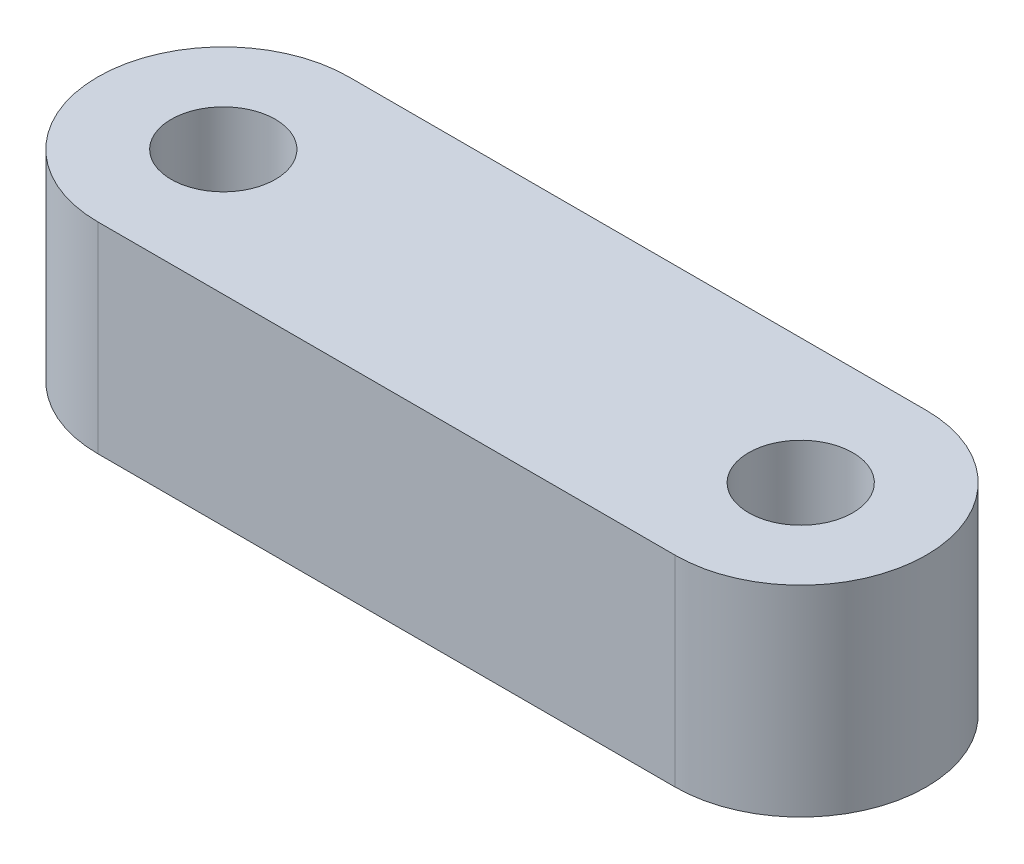
ISO-10303-21;
HEADER;
FILE_DESCRIPTION(('STEP AP214'),'2;1');
FILE_NAME('part.step','',(''),(''),'','','');
FILE_SCHEMA(('AUTOMOTIVE_DESIGN { 1 0 10303 214 1 1 1 1 }'));
ENDSEC;
DATA;
#1=APPLICATION_CONTEXT('core data for automotive mechanical design processes');
#2=APPLICATION_PROTOCOL_DEFINITION('international standard','automotive_design',2000,#1);
#3=PRODUCT_CONTEXT('',#1,'mechanical');
#4=PRODUCT('Part','Part','',(#3));
#5=PRODUCT_RELATED_PRODUCT_CATEGORY('part','',(#4));
#6=PRODUCT_DEFINITION_FORMATION('','',#4);
#7=PRODUCT_DEFINITION_CONTEXT('part definition',#1,'design');
#8=PRODUCT_DEFINITION('design','',#6,#7);
#9=PRODUCT_DEFINITION_SHAPE('','',#8);
#10=(LENGTH_UNIT() NAMED_UNIT(*) SI_UNIT(.MILLI.,.METRE.));
#11=(NAMED_UNIT(*) PLANE_ANGLE_UNIT() SI_UNIT($,.RADIAN.));
#12=(NAMED_UNIT(*) SI_UNIT($,.STERADIAN.) SOLID_ANGLE_UNIT());
#13=UNCERTAINTY_MEASURE_WITH_UNIT(LENGTH_MEASURE(1.E-05),#10,'distance_accuracy_value','');
#14=(GEOMETRIC_REPRESENTATION_CONTEXT(3) GLOBAL_UNCERTAINTY_ASSIGNED_CONTEXT((#13)) GLOBAL_UNIT_ASSIGNED_CONTEXT((#10,
#11,#12)) REPRESENTATION_CONTEXT('',''));
#15=CARTESIAN_POINT('',(0.,0.,0.));
#16=DIRECTION('',(0.,0.,1.));
#17=DIRECTION('',(1.,0.,0.));
#18=AXIS2_PLACEMENT_3D('',#15,#16,#17);
#19=CARTESIAN_POINT('',(0.,8.,0.));
#20=DIRECTION('',(0.,-1.,0.));
#21=DIRECTION('',(0.,0.,-1.));
#22=AXIS2_PLACEMENT_3D('',#19,#20,#21);
#23=CYLINDRICAL_SURFACE('',#22,5.);
#24=CARTESIAN_POINT('',(0.,0.,0.));
#25=DIRECTION('',(0.,1.,0.));
#26=DIRECTION('',(0.,0.,1.));
#27=AXIS2_PLACEMENT_3D('',#24,#25,#26);
#28=CIRCLE('',#27,5.);
#29=CARTESIAN_POINT('',(0.,0.,-5.));
#30=VERTEX_POINT('',#29);
#31=CARTESIAN_POINT('',(0.,0.,5.));
#32=VERTEX_POINT('',#31);
#33=EDGE_CURVE('E106',#30,#32,#28,.T.);
#34=ORIENTED_EDGE('',*,*,#33,.T.);
#35=DIRECTION('',(0.,-1.,0.));
#36=VECTOR('',#35,1.);
#37=CARTESIAN_POINT('',(0.,8.,5.));
#38=LINE('',#37,#36);
#39=CARTESIAN_POINT('',(0.,8.,5.));
#40=VERTEX_POINT('',#39);
#41=EDGE_CURVE('E11',#40,#32,#38,.T.);
#42=ORIENTED_EDGE('',*,*,#41,.F.);
#43=CARTESIAN_POINT('',(0.,8.,0.));
#44=DIRECTION('',(0.,1.,0.));
#45=DIRECTION('',(0.,0.,1.));
#46=AXIS2_PLACEMENT_3D('',#43,#44,#45);
#47=CIRCLE('',#46,5.);
#48=CARTESIAN_POINT('',(0.,8.,-5.));
#49=VERTEX_POINT('',#48);
#50=EDGE_CURVE('E90',#49,#40,#47,.T.);
#51=ORIENTED_EDGE('',*,*,#50,.F.);
#52=DIRECTION('',(0.,-1.,0.));
#53=VECTOR('',#52,1.);
#54=CARTESIAN_POINT('',(0.,8.,-5.));
#55=LINE('',#54,#53);
#56=EDGE_CURVE('E102',#49,#30,#55,.T.);
#57=ORIENTED_EDGE('',*,*,#56,.T.);
#58=EDGE_LOOP('',(#34,#42,#51,#57));
#59=FACE_BOUND('',#58,.T.);
#60=ADVANCED_FACE('F38',(#59),#23,.T.);
#61=CARTESIAN_POINT('',(0.,8.,5.));
#62=DIRECTION('',(0.,0.,-1.));
#63=DIRECTION('',(-1.,0.,0.));
#64=AXIS2_PLACEMENT_3D('',#61,#62,#63);
#65=PLANE('',#64);
#66=DIRECTION('',(1.,0.,0.));
#67=VECTOR('',#66,1.);
#68=CARTESIAN_POINT('',(0.,0.,5.));
#69=LINE('',#68,#67);
#70=CARTESIAN_POINT('',(23.,0.,5.));
#71=VERTEX_POINT('',#70);
#72=EDGE_CURVE('E95',#32,#71,#69,.T.);
#73=ORIENTED_EDGE('',*,*,#72,.T.);
#74=DIRECTION('',(0.,-1.,0.));
#75=VECTOR('',#74,1.);
#76=CARTESIAN_POINT('',(23.,8.,5.));
#77=LINE('',#76,#75);
#78=CARTESIAN_POINT('',(23.,8.,5.));
#79=VERTEX_POINT('',#78);
#80=EDGE_CURVE('E47',#79,#71,#77,.T.);
#81=ORIENTED_EDGE('',*,*,#80,.F.);
#82=DIRECTION('',(1.,0.,0.));
#83=VECTOR('',#82,1.);
#84=CARTESIAN_POINT('',(0.,8.,5.));
#85=LINE('',#84,#83);
#86=EDGE_CURVE('E85',#40,#79,#85,.T.);
#87=ORIENTED_EDGE('',*,*,#86,.F.);
#88=ORIENTED_EDGE('',*,*,#41,.T.);
#89=EDGE_LOOP('',(#73,#81,#87,#88));
#90=FACE_BOUND('',#89,.T.);
#91=ADVANCED_FACE('F94',(#90),#65,.F.);
#92=CARTESIAN_POINT('',(23.,8.,0.));
#93=DIRECTION('',(0.,-1.,0.));
#94=DIRECTION('',(0.,0.,-1.));
#95=AXIS2_PLACEMENT_3D('',#92,#93,#94);
#96=CYLINDRICAL_SURFACE('',#95,5.);
#97=CARTESIAN_POINT('',(23.,0.,0.));
#98=DIRECTION('',(0.,1.,0.));
#99=DIRECTION('',(0.,0.,1.));
#100=AXIS2_PLACEMENT_3D('',#97,#98,#99);
#101=CIRCLE('',#100,5.);
#102=CARTESIAN_POINT('',(23.,0.,-5.));
#103=VERTEX_POINT('',#102);
#104=EDGE_CURVE('E72',#71,#103,#101,.T.);
#105=ORIENTED_EDGE('',*,*,#104,.T.);
#106=DIRECTION('',(0.,-1.,0.));
#107=VECTOR('',#106,1.);
#108=CARTESIAN_POINT('',(23.,8.,-5.));
#109=LINE('',#108,#107);
#110=CARTESIAN_POINT('',(23.,8.,-5.));
#111=VERTEX_POINT('',#110);
#112=EDGE_CURVE('E97',#111,#103,#109,.T.);
#113=ORIENTED_EDGE('',*,*,#112,.F.);
#114=CARTESIAN_POINT('',(23.,8.,0.));
#115=DIRECTION('',(0.,1.,0.));
#116=DIRECTION('',(0.,0.,1.));
#117=AXIS2_PLACEMENT_3D('',#114,#115,#116);
#118=CIRCLE('',#117,5.);
#119=EDGE_CURVE('E88',#79,#111,#118,.T.);
#120=ORIENTED_EDGE('',*,*,#119,.F.);
#121=ORIENTED_EDGE('',*,*,#80,.T.);
#122=EDGE_LOOP('',(#105,#113,#120,#121));
#123=FACE_BOUND('',#122,.T.);
#124=ADVANCED_FACE('F98',(#123),#96,.T.);
#125=CARTESIAN_POINT('',(0.,8.,-5.));
#126=DIRECTION('',(0.,0.,1.));
#127=DIRECTION('',(1.,0.,0.));
#128=AXIS2_PLACEMENT_3D('',#125,#126,#127);
#129=PLANE('',#128);
#130=DIRECTION('',(-1.,0.,0.));
#131=VECTOR('',#130,1.);
#132=CARTESIAN_POINT('',(0.,0.,-5.));
#133=LINE('',#132,#131);
#134=EDGE_CURVE('E78',#103,#30,#133,.T.);
#135=ORIENTED_EDGE('',*,*,#134,.T.);
#136=ORIENTED_EDGE('',*,*,#56,.F.);
#137=DIRECTION('',(-1.,0.,0.));
#138=VECTOR('',#137,1.);
#139=CARTESIAN_POINT('',(0.,8.,-5.));
#140=LINE('',#139,#138);
#141=EDGE_CURVE('E55',#111,#49,#140,.T.);
#142=ORIENTED_EDGE('',*,*,#141,.F.);
#143=ORIENTED_EDGE('',*,*,#112,.T.);
#144=EDGE_LOOP('',(#135,#136,#142,#143));
#145=FACE_BOUND('',#144,.T.);
#146=ADVANCED_FACE('F120',(#145),#129,.F.);
#147=CARTESIAN_POINT('',(0.,8.,0.));
#148=DIRECTION('',(0.,1.,0.));
#149=DIRECTION('',(0.,0.,1.));
#150=AXIS2_PLACEMENT_3D('',#147,#148,#149);
#151=PLANE('',#150);
#152=CARTESIAN_POINT('',(23.,8.,0.));
#153=DIRECTION('',(0.,-1.,0.));
#154=DIRECTION('',(0.,0.,-1.));
#155=AXIS2_PLACEMENT_3D('',#152,#153,#154);
#156=CIRCLE('',#155,2.075);
#157=CARTESIAN_POINT('',(23.,8.,-2.075));
#158=VERTEX_POINT('',#157);
#159=EDGE_CURVE('E142',#158,#158,#156,.T.);
#160=ORIENTED_EDGE('',*,*,#159,.T.);
#161=EDGE_LOOP('',(#160));
#162=FACE_BOUND('',#161,.T.);
#163=CARTESIAN_POINT('',(0.,8.,0.));
#164=DIRECTION('',(0.,-1.,0.));
#165=DIRECTION('',(0.,0.,-1.));
#166=AXIS2_PLACEMENT_3D('',#163,#164,#165);
#167=CIRCLE('',#166,2.075);
#168=CARTESIAN_POINT('',(0.,8.,-2.075));
#169=VERTEX_POINT('',#168);
#170=EDGE_CURVE('E110',#169,#169,#167,.T.);
#171=ORIENTED_EDGE('',*,*,#170,.T.);
#172=EDGE_LOOP('',(#171));
#173=FACE_BOUND('',#172,.T.);
#174=ORIENTED_EDGE('',*,*,#50,.T.);
#175=ORIENTED_EDGE('',*,*,#86,.T.);
#176=ORIENTED_EDGE('',*,*,#119,.T.);
#177=ORIENTED_EDGE('',*,*,#141,.T.);
#178=EDGE_LOOP('',(#174,#175,#176,#177));
#179=FACE_BOUND('',#178,.T.);
#180=ADVANCED_FACE('F86',(#162,#173,#179),#151,.T.);
#181=CARTESIAN_POINT('',(0.,0.,0.));
#182=DIRECTION('',(0.,1.,0.));
#183=DIRECTION('',(0.,0.,1.));
#184=AXIS2_PLACEMENT_3D('',#181,#182,#183);
#185=PLANE('',#184);
#186=CARTESIAN_POINT('',(23.,0.,0.));
#187=DIRECTION('',(0.,-1.,0.));
#188=DIRECTION('',(0.,0.,-1.));
#189=AXIS2_PLACEMENT_3D('',#186,#187,#188);
#190=CIRCLE('',#189,3.75);
#191=CARTESIAN_POINT('',(23.,0.,-3.75));
#192=VERTEX_POINT('',#191);
#193=EDGE_CURVE('E154',#192,#192,#190,.T.);
#194=ORIENTED_EDGE('',*,*,#193,.F.);
#195=EDGE_LOOP('',(#194));
#196=FACE_BOUND('',#195,.T.);
#197=CARTESIAN_POINT('',(0.,0.,0.));
#198=DIRECTION('',(0.,-1.,0.));
#199=DIRECTION('',(0.,0.,-1.));
#200=AXIS2_PLACEMENT_3D('',#197,#198,#199);
#201=CIRCLE('',#200,3.75);
#202=CARTESIAN_POINT('',(0.,0.,-3.75));
#203=VERTEX_POINT('',#202);
#204=EDGE_CURVE('E138',#203,#203,#201,.T.);
#205=ORIENTED_EDGE('',*,*,#204,.F.);
#206=EDGE_LOOP('',(#205));
#207=FACE_BOUND('',#206,.T.);
#208=ORIENTED_EDGE('',*,*,#33,.F.);
#209=ORIENTED_EDGE('',*,*,#134,.F.);
#210=ORIENTED_EDGE('',*,*,#104,.F.);
#211=ORIENTED_EDGE('',*,*,#72,.F.);
#212=EDGE_LOOP('',(#208,#209,#210,#211));
#213=FACE_BOUND('',#212,.T.);
#214=ADVANCED_FACE('F123',(#196,#207,#213),#185,.F.);
#215=CARTESIAN_POINT('',(0.,0.,0.));
#216=DIRECTION('',(0.,-1.,0.));
#217=DIRECTION('',(0.,0.,-1.));
#218=AXIS2_PLACEMENT_3D('',#215,#216,#217);
#219=CYLINDRICAL_SURFACE('',#218,2.075);
#220=CARTESIAN_POINT('',(0.,3.5,0.));
#221=DIRECTION('',(0.,-1.,0.));
#222=DIRECTION('',(0.,0.,-1.));
#223=AXIS2_PLACEMENT_3D('',#220,#221,#222);
#224=CIRCLE('',#223,2.075);
#225=CARTESIAN_POINT('',(0.,3.5,-2.075));
#226=VERTEX_POINT('',#225);
#227=EDGE_CURVE('E130',#226,#226,#224,.T.);
#228=ORIENTED_EDGE('',*,*,#227,.T.);
#229=EDGE_LOOP('',(#228));
#230=FACE_BOUND('',#229,.T.);
#231=ORIENTED_EDGE('',*,*,#170,.F.);
#232=EDGE_LOOP('',(#231));
#233=FACE_BOUND('',#232,.T.);
#234=ADVANCED_FACE('F164',(#230,#233),#219,.F.);
#235=CARTESIAN_POINT('',(-2.075,3.5,0.));
#236=DIRECTION('',(0.,-1.,0.));
#237=DIRECTION('',(0.,0.,-1.));
#238=AXIS2_PLACEMENT_3D('',#235,#236,#237);
#239=PLANE('',#238);
#240=CARTESIAN_POINT('',(0.,3.5,0.));
#241=DIRECTION('',(0.,-1.,0.));
#242=DIRECTION('',(0.,0.,-1.));
#243=AXIS2_PLACEMENT_3D('',#240,#241,#242);
#244=CIRCLE('',#243,3.75);
#245=CARTESIAN_POINT('',(0.,3.5,-3.75));
#246=VERTEX_POINT('',#245);
#247=EDGE_CURVE('E134',#246,#246,#244,.T.);
#248=ORIENTED_EDGE('',*,*,#247,.T.);
#249=EDGE_LOOP('',(#248));
#250=FACE_BOUND('',#249,.T.);
#251=ORIENTED_EDGE('',*,*,#227,.F.);
#252=EDGE_LOOP('',(#251));
#253=FACE_BOUND('',#252,.T.);
#254=ADVANCED_FACE('F172',(#250,#253),#239,.T.);
#255=CARTESIAN_POINT('',(0.,0.,0.));
#256=DIRECTION('',(0.,-1.,0.));
#257=DIRECTION('',(0.,0.,-1.));
#258=AXIS2_PLACEMENT_3D('',#255,#256,#257);
#259=CYLINDRICAL_SURFACE('',#258,3.75);
#260=ORIENTED_EDGE('',*,*,#204,.T.);
#261=EDGE_LOOP('',(#260));
#262=FACE_BOUND('',#261,.T.);
#263=ORIENTED_EDGE('',*,*,#247,.F.);
#264=EDGE_LOOP('',(#263));
#265=FACE_BOUND('',#264,.T.);
#266=ADVANCED_FACE('F168',(#262,#265),#259,.F.);
#267=CARTESIAN_POINT('',(23.,0.,0.));
#268=DIRECTION('',(0.,-1.,0.));
#269=DIRECTION('',(0.,0.,-1.));
#270=AXIS2_PLACEMENT_3D('',#267,#268,#269);
#271=CYLINDRICAL_SURFACE('',#270,2.075);
#272=CARTESIAN_POINT('',(23.,3.5,0.));
#273=DIRECTION('',(0.,-1.,0.));
#274=DIRECTION('',(0.,0.,-1.));
#275=AXIS2_PLACEMENT_3D('',#272,#273,#274);
#276=CIRCLE('',#275,2.075);
#277=CARTESIAN_POINT('',(23.,3.5,-2.075));
#278=VERTEX_POINT('',#277);
#279=EDGE_CURVE('E146',#278,#278,#276,.T.);
#280=ORIENTED_EDGE('',*,*,#279,.T.);
#281=EDGE_LOOP('',(#280));
#282=FACE_BOUND('',#281,.T.);
#283=ORIENTED_EDGE('',*,*,#159,.F.);
#284=EDGE_LOOP('',(#283));
#285=FACE_BOUND('',#284,.T.);
#286=ADVANCED_FACE('F171',(#282,#285),#271,.F.);
#287=CARTESIAN_POINT('',(20.925,3.5,0.));
#288=DIRECTION('',(0.,-1.,0.));
#289=DIRECTION('',(0.,0.,-1.));
#290=AXIS2_PLACEMENT_3D('',#287,#288,#289);
#291=PLANE('',#290);
#292=CARTESIAN_POINT('',(23.,3.5,0.));
#293=DIRECTION('',(0.,-1.,0.));
#294=DIRECTION('',(0.,0.,-1.));
#295=AXIS2_PLACEMENT_3D('',#292,#293,#294);
#296=CIRCLE('',#295,3.75);
#297=CARTESIAN_POINT('',(23.,3.5,-3.75));
#298=VERTEX_POINT('',#297);
#299=EDGE_CURVE('E150',#298,#298,#296,.T.);
#300=ORIENTED_EDGE('',*,*,#299,.T.);
#301=EDGE_LOOP('',(#300));
#302=FACE_BOUND('',#301,.T.);
#303=ORIENTED_EDGE('',*,*,#279,.F.);
#304=EDGE_LOOP('',(#303));
#305=FACE_BOUND('',#304,.T.);
#306=ADVANCED_FACE('F235',(#302,#305),#291,.T.);
#307=CARTESIAN_POINT('',(23.,0.,0.));
#308=DIRECTION('',(0.,-1.,0.));
#309=DIRECTION('',(0.,0.,-1.));
#310=AXIS2_PLACEMENT_3D('',#307,#308,#309);
#311=CYLINDRICAL_SURFACE('',#310,3.75);
#312=ORIENTED_EDGE('',*,*,#193,.T.);
#313=EDGE_LOOP('',(#312));
#314=FACE_BOUND('',#313,.T.);
#315=ORIENTED_EDGE('',*,*,#299,.F.);
#316=EDGE_LOOP('',(#315));
#317=FACE_BOUND('',#316,.T.);
#318=ADVANCED_FACE('F159',(#314,#317),#311,.F.);
#319=CLOSED_SHELL('',(#60,#91,#124,#146,#180,#214,#234,#254,#266,#286,#306,#318));
#320=MANIFOLD_SOLID_BREP('B2',#319);
#321=ADVANCED_BREP_SHAPE_REPRESENTATION('',(#18,#320),#14);
#322=SHAPE_DEFINITION_REPRESENTATION(#9,#321);
ENDSEC;
END-ISO-10303-21;
